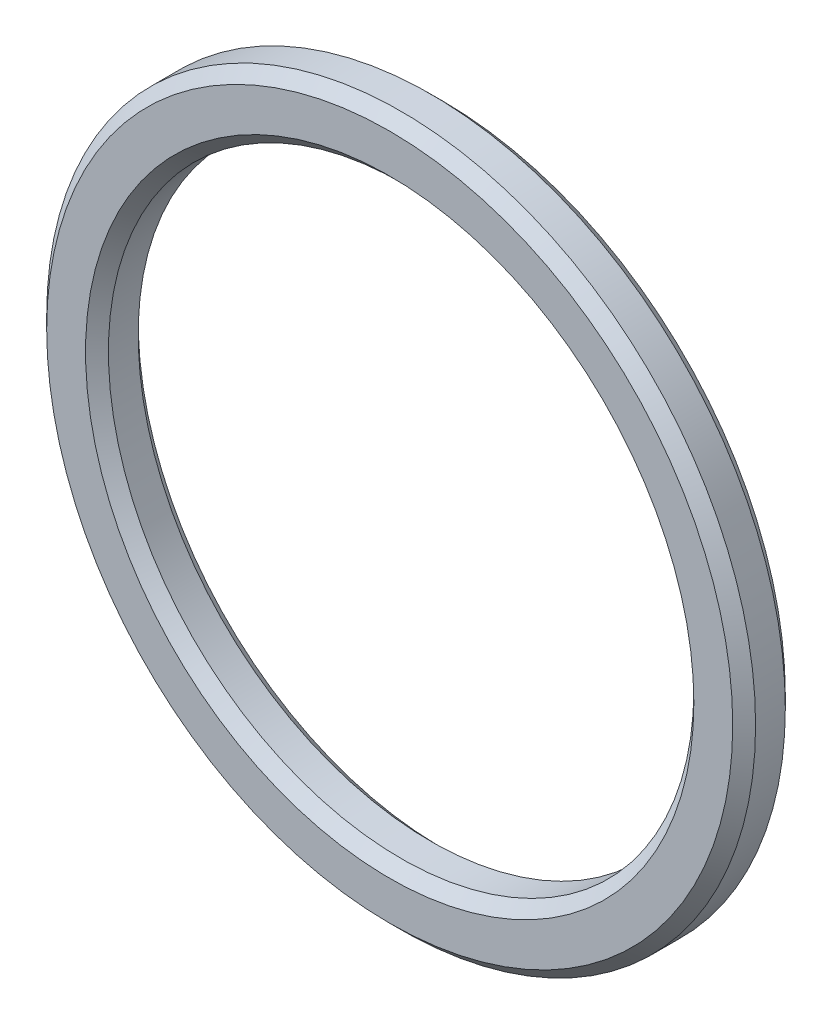
ISO-10303-21;
HEADER;
FILE_DESCRIPTION(('STEP AP214'),'2;1');
FILE_NAME('part.step','',(''),(''),'','','');
FILE_SCHEMA(('AUTOMOTIVE_DESIGN { 1 0 10303 214 1 1 1 1 }'));
ENDSEC;
DATA;
#1=APPLICATION_CONTEXT('core data for automotive mechanical design processes');
#2=APPLICATION_PROTOCOL_DEFINITION('international standard','automotive_design',2000,#1);
#3=PRODUCT_CONTEXT('',#1,'mechanical');
#4=PRODUCT('Part','Part','',(#3));
#5=PRODUCT_RELATED_PRODUCT_CATEGORY('part','',(#4));
#6=PRODUCT_DEFINITION_FORMATION('','',#4);
#7=PRODUCT_DEFINITION_CONTEXT('part definition',#1,'design');
#8=PRODUCT_DEFINITION('design','',#6,#7);
#9=PRODUCT_DEFINITION_SHAPE('','',#8);
#10=(LENGTH_UNIT() NAMED_UNIT(*) SI_UNIT(.MILLI.,.METRE.));
#11=(NAMED_UNIT(*) PLANE_ANGLE_UNIT() SI_UNIT($,.RADIAN.));
#12=(NAMED_UNIT(*) SI_UNIT($,.STERADIAN.) SOLID_ANGLE_UNIT());
#13=UNCERTAINTY_MEASURE_WITH_UNIT(LENGTH_MEASURE(1.E-05),#10,'distance_accuracy_value','');
#14=(GEOMETRIC_REPRESENTATION_CONTEXT(3) GLOBAL_UNCERTAINTY_ASSIGNED_CONTEXT((#13)) GLOBAL_UNIT_ASSIGNED_CONTEXT((#10,
#11,#12)) REPRESENTATION_CONTEXT('',''));
#15=CARTESIAN_POINT('',(0.,0.,0.));
#16=DIRECTION('',(0.,0.,1.));
#17=DIRECTION('',(1.,0.,0.));
#18=AXIS2_PLACEMENT_3D('',#15,#16,#17);
#19=CARTESIAN_POINT('',(0.,0.,2.3));
#20=DIRECTION('',(0.,0.,1.));
#21=DIRECTION('',(1.,0.,0.));
#22=AXIS2_PLACEMENT_3D('',#19,#20,#21);
#23=PLANE('',#22);
#24=CARTESIAN_POINT('',(0.,0.,2.3));
#25=DIRECTION('',(0.,0.,1.));
#26=DIRECTION('',(1.,0.,0.));
#27=AXIS2_PLACEMENT_3D('',#24,#25,#26);
#28=CIRCLE('',#27,13.3);
#29=CARTESIAN_POINT('',(13.3,0.,2.3));
#30=VERTEX_POINT('',#29);
#31=EDGE_CURVE('E10',#30,#30,#28,.F.);
#32=ORIENTED_EDGE('',*,*,#31,.T.);
#33=EDGE_LOOP('',(#32));
#34=FACE_BOUND('',#33,.T.);
#35=CARTESIAN_POINT('',(0.,0.,2.3));
#36=DIRECTION('',(0.,0.,1.));
#37=DIRECTION('',(1.,0.,0.));
#38=AXIS2_PLACEMENT_3D('',#35,#36,#37);
#39=CIRCLE('',#38,15.);
#40=CARTESIAN_POINT('',(15.,0.,2.3));
#41=VERTEX_POINT('',#40);
#42=EDGE_CURVE('E40',#41,#41,#39,.T.);
#43=ORIENTED_EDGE('',*,*,#42,.T.);
#44=EDGE_LOOP('',(#43));
#45=FACE_BOUND('',#44,.T.);
#46=ADVANCED_FACE('F33',(#34,#45),#23,.T.);
#47=CARTESIAN_POINT('',(0.,0.,0.));
#48=DIRECTION('',(0.,0.,1.));
#49=DIRECTION('',(1.,0.,0.));
#50=AXIS2_PLACEMENT_3D('',#47,#48,#49);
#51=PLANE('',#50);
#52=CARTESIAN_POINT('',(0.,0.,0.));
#53=DIRECTION('',(0.,0.,1.));
#54=DIRECTION('',(1.,0.,0.));
#55=AXIS2_PLACEMENT_3D('',#52,#53,#54);
#56=CIRCLE('',#55,13.3);
#57=CARTESIAN_POINT('',(13.3,0.,0.));
#58=VERTEX_POINT('',#57);
#59=EDGE_CURVE('E59',#58,#58,#56,.T.);
#60=ORIENTED_EDGE('',*,*,#59,.T.);
#61=EDGE_LOOP('',(#60));
#62=FACE_BOUND('',#61,.T.);
#63=CARTESIAN_POINT('',(0.,0.,0.));
#64=DIRECTION('',(0.,0.,1.));
#65=DIRECTION('',(1.,0.,0.));
#66=AXIS2_PLACEMENT_3D('',#63,#64,#65);
#67=CIRCLE('',#66,15.);
#68=CARTESIAN_POINT('',(15.,0.,0.));
#69=VERTEX_POINT('',#68);
#70=EDGE_CURVE('E62',#69,#69,#67,.F.);
#71=ORIENTED_EDGE('',*,*,#70,.T.);
#72=EDGE_LOOP('',(#71));
#73=FACE_BOUND('',#72,.T.);
#74=ADVANCED_FACE('F66',(#62,#73),#51,.F.);
#75=CARTESIAN_POINT('',(0.,0.,2.3));
#76=DIRECTION('',(0.,0.,-1.));
#77=DIRECTION('',(-1.,0.,0.));
#78=AXIS2_PLACEMENT_3D('',#75,#76,#77);
#79=CYLINDRICAL_SURFACE('',#78,15.5);
#80=CARTESIAN_POINT('',(0.,0.,0.500000000000002));
#81=DIRECTION('',(0.,0.,1.));
#82=DIRECTION('',(1.,0.,0.));
#83=AXIS2_PLACEMENT_3D('',#80,#81,#82);
#84=CIRCLE('',#83,15.5);
#85=CARTESIAN_POINT('',(15.5,0.,0.500000000000002));
#86=VERTEX_POINT('',#85);
#87=EDGE_CURVE('E44',#86,#86,#84,.T.);
#88=ORIENTED_EDGE('',*,*,#87,.T.);
#89=EDGE_LOOP('',(#88));
#90=FACE_BOUND('',#89,.T.);
#91=CARTESIAN_POINT('',(0.,0.,1.80000000000001));
#92=DIRECTION('',(0.,0.,1.));
#93=DIRECTION('',(1.,0.,0.));
#94=AXIS2_PLACEMENT_3D('',#91,#92,#93);
#95=CIRCLE('',#94,15.5);
#96=CARTESIAN_POINT('',(15.5,0.,1.80000000000001));
#97=VERTEX_POINT('',#96);
#98=EDGE_CURVE('E48',#97,#97,#95,.F.);
#99=ORIENTED_EDGE('',*,*,#98,.T.);
#100=EDGE_LOOP('',(#99));
#101=FACE_BOUND('',#100,.T.);
#102=ADVANCED_FACE('F76',(#90,#101),#79,.T.);
#103=CARTESIAN_POINT('',(0.,0.,2.3));
#104=DIRECTION('',(0.,0.,-1.));
#105=DIRECTION('',(-1.,0.,0.));
#106=AXIS2_PLACEMENT_3D('',#103,#104,#105);
#107=CYLINDRICAL_SURFACE('',#106,12.8);
#108=CARTESIAN_POINT('',(0.,0.,0.499999999999995));
#109=DIRECTION('',(0.,0.,1.));
#110=DIRECTION('',(1.,0.,0.));
#111=AXIS2_PLACEMENT_3D('',#108,#109,#110);
#112=CIRCLE('',#111,12.8);
#113=CARTESIAN_POINT('',(12.8,0.,0.499999999999995));
#114=VERTEX_POINT('',#113);
#115=EDGE_CURVE('E53',#114,#114,#112,.F.);
#116=ORIENTED_EDGE('',*,*,#115,.T.);
#117=EDGE_LOOP('',(#116));
#118=FACE_BOUND('',#117,.T.);
#119=CARTESIAN_POINT('',(0.,0.,1.8));
#120=DIRECTION('',(0.,0.,1.));
#121=DIRECTION('',(1.,0.,0.));
#122=AXIS2_PLACEMENT_3D('',#119,#120,#121);
#123=CIRCLE('',#122,12.8);
#124=CARTESIAN_POINT('',(12.8,0.,1.8));
#125=VERTEX_POINT('',#124);
#126=EDGE_CURVE('E56',#125,#125,#123,.T.);
#127=ORIENTED_EDGE('',*,*,#126,.T.);
#128=EDGE_LOOP('',(#127));
#129=FACE_BOUND('',#128,.T.);
#130=ADVANCED_FACE('F79',(#118,#129),#107,.F.);
#131=CARTESIAN_POINT('',(0.,0.,0.));
#132=DIRECTION('',(0.,0.,-1.));
#133=DIRECTION('',(-1.,0.,0.));
#134=AXIS2_PLACEMENT_3D('',#131,#132,#133);
#135=CONICAL_SURFACE('',#134,13.3,0.785398163397445);
#136=ORIENTED_EDGE('',*,*,#115,.F.);
#137=EDGE_LOOP('',(#136));
#138=FACE_BOUND('',#137,.T.);
#139=ORIENTED_EDGE('',*,*,#59,.F.);
#140=EDGE_LOOP('',(#139));
#141=FACE_BOUND('',#140,.T.);
#142=ADVANCED_FACE('F72',(#138,#141),#135,.F.);
#143=CARTESIAN_POINT('',(0.,0.,0.500000000000002));
#144=DIRECTION('',(0.,0.,1.));
#145=DIRECTION('',(1.,0.,0.));
#146=AXIS2_PLACEMENT_3D('',#143,#144,#145);
#147=CONICAL_SURFACE('',#146,15.5,0.78539816339745);
#148=ORIENTED_EDGE('',*,*,#70,.F.);
#149=EDGE_LOOP('',(#148));
#150=FACE_BOUND('',#149,.T.);
#151=ORIENTED_EDGE('',*,*,#87,.F.);
#152=EDGE_LOOP('',(#151));
#153=FACE_BOUND('',#152,.T.);
#154=ADVANCED_FACE('F68',(#150,#153),#147,.T.);
#155=CARTESIAN_POINT('',(0.,0.,1.8));
#156=DIRECTION('',(0.,0.,1.));
#157=DIRECTION('',(1.,0.,0.));
#158=AXIS2_PLACEMENT_3D('',#155,#156,#157);
#159=CONICAL_SURFACE('',#158,12.8,0.78539816339745);
#160=ORIENTED_EDGE('',*,*,#31,.F.);
#161=EDGE_LOOP('',(#160));
#162=FACE_BOUND('',#161,.T.);
#163=ORIENTED_EDGE('',*,*,#126,.F.);
#164=EDGE_LOOP('',(#163));
#165=FACE_BOUND('',#164,.T.);
#166=ADVANCED_FACE('F71',(#162,#165),#159,.F.);
#167=CARTESIAN_POINT('',(0.,0.,2.3));
#168=DIRECTION('',(0.,0.,-1.));
#169=DIRECTION('',(-1.,0.,0.));
#170=AXIS2_PLACEMENT_3D('',#167,#168,#169);
#171=CONICAL_SURFACE('',#170,15.,0.785398163397443);
#172=ORIENTED_EDGE('',*,*,#98,.F.);
#173=EDGE_LOOP('',(#172));
#174=FACE_BOUND('',#173,.T.);
#175=ORIENTED_EDGE('',*,*,#42,.F.);
#176=EDGE_LOOP('',(#175));
#177=FACE_BOUND('',#176,.T.);
#178=ADVANCED_FACE('F35',(#174,#177),#171,.T.);
#179=CLOSED_SHELL('',(#46,#74,#102,#130,#142,#154,#166,#178));
#180=MANIFOLD_SOLID_BREP('B2',#179);
#181=ADVANCED_BREP_SHAPE_REPRESENTATION('',(#18,#180),#14);
#182=SHAPE_DEFINITION_REPRESENTATION(#9,#181);
ENDSEC;
END-ISO-10303-21;
